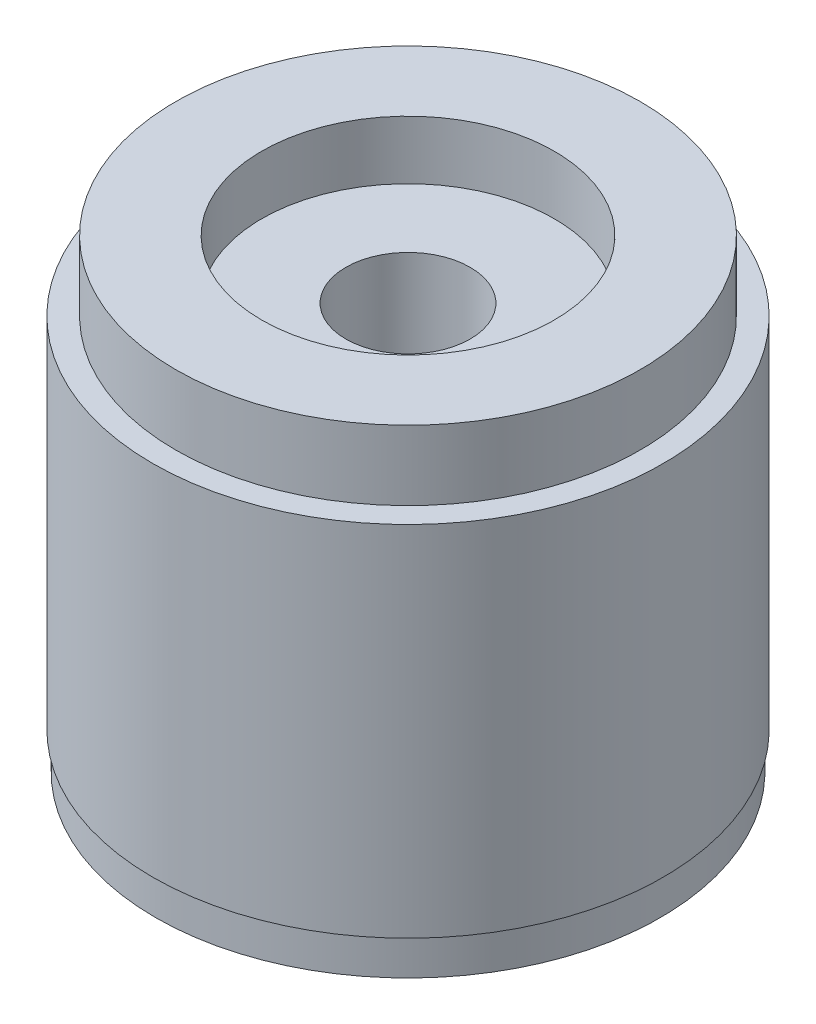
ISO-10303-21;
HEADER;
FILE_DESCRIPTION(('STEP AP214'),'2;1');
FILE_NAME('part.step','',(''),(''),'','','');
FILE_SCHEMA(('AUTOMOTIVE_DESIGN { 1 0 10303 214 1 1 1 1 }'));
ENDSEC;
DATA;
#1=APPLICATION_CONTEXT('core data for automotive mechanical design processes');
#2=APPLICATION_PROTOCOL_DEFINITION('international standard','automotive_design',2000,#1);
#3=PRODUCT_CONTEXT('',#1,'mechanical');
#4=PRODUCT('Part','Part','',(#3));
#5=PRODUCT_RELATED_PRODUCT_CATEGORY('part','',(#4));
#6=PRODUCT_DEFINITION_FORMATION('','',#4);
#7=PRODUCT_DEFINITION_CONTEXT('part definition',#1,'design');
#8=PRODUCT_DEFINITION('design','',#6,#7);
#9=PRODUCT_DEFINITION_SHAPE('','',#8);
#10=(LENGTH_UNIT() NAMED_UNIT(*) SI_UNIT(.MILLI.,.METRE.));
#11=(NAMED_UNIT(*) PLANE_ANGLE_UNIT() SI_UNIT($,.RADIAN.));
#12=(NAMED_UNIT(*) SI_UNIT($,.STERADIAN.) SOLID_ANGLE_UNIT());
#13=UNCERTAINTY_MEASURE_WITH_UNIT(LENGTH_MEASURE(1.E-05),#10,'distance_accuracy_value','');
#14=(GEOMETRIC_REPRESENTATION_CONTEXT(3) GLOBAL_UNCERTAINTY_ASSIGNED_CONTEXT((#13)) GLOBAL_UNIT_ASSIGNED_CONTEXT((#10,
#11,#12)) REPRESENTATION_CONTEXT('',''));
#15=CARTESIAN_POINT('',(0.,0.,0.));
#16=DIRECTION('',(0.,0.,1.));
#17=DIRECTION('',(1.,0.,0.));
#18=AXIS2_PLACEMENT_3D('',#15,#16,#17);
#19=CARTESIAN_POINT('',(0.,63.5,0.));
#20=DIRECTION('',(0.,-1.,0.));
#21=DIRECTION('',(0.,0.,-1.));
#22=AXIS2_PLACEMENT_3D('',#19,#20,#21);
#23=CYLINDRICAL_SURFACE('',#22,8.5);
#24=CARTESIAN_POINT('',(0.,55.5,0.));
#25=DIRECTION('',(0.,1.,0.));
#26=DIRECTION('',(0.,0.,1.));
#27=AXIS2_PLACEMENT_3D('',#24,#25,#26);
#28=CIRCLE('',#27,8.5);
#29=CARTESIAN_POINT('',(0.,55.5,8.5));
#30=VERTEX_POINT('',#29);
#31=EDGE_CURVE('E55',#30,#30,#28,.T.);
#32=ORIENTED_EDGE('',*,*,#31,.T.);
#33=EDGE_LOOP('',(#32));
#34=FACE_BOUND('',#33,.T.);
#35=CARTESIAN_POINT('',(0.,5.,0.));
#36=DIRECTION('',(0.,-1.,0.));
#37=DIRECTION('',(0.,0.,-1.));
#38=AXIS2_PLACEMENT_3D('',#35,#36,#37);
#39=CIRCLE('',#38,8.5);
#40=CARTESIAN_POINT('',(0.,5.,-8.5));
#41=VERTEX_POINT('',#40);
#42=EDGE_CURVE('E39',#41,#41,#39,.F.);
#43=ORIENTED_EDGE('',*,*,#42,.F.);
#44=EDGE_LOOP('',(#43));
#45=FACE_BOUND('',#44,.T.);
#46=ADVANCED_FACE('F35',(#34,#45),#23,.F.);
#47=CARTESIAN_POINT('',(0.,63.5,0.));
#48=DIRECTION('',(0.,-1.,0.));
#49=DIRECTION('',(0.,0.,-1.));
#50=AXIS2_PLACEMENT_3D('',#47,#48,#49);
#51=CYLINDRICAL_SURFACE('',#50,34.91);
#52=CARTESIAN_POINT('',(0.,5.,0.));
#53=DIRECTION('',(0.,-1.,0.));
#54=DIRECTION('',(0.,0.,-1.));
#55=AXIS2_PLACEMENT_3D('',#52,#53,#54);
#56=CIRCLE('',#55,34.91);
#57=CARTESIAN_POINT('',(0.,5.,-34.91));
#58=VERTEX_POINT('',#57);
#59=EDGE_CURVE('E11',#58,#58,#56,.T.);
#60=ORIENTED_EDGE('',*,*,#59,.F.);
#61=EDGE_LOOP('',(#60));
#62=FACE_BOUND('',#61,.T.);
#63=CARTESIAN_POINT('',(0.,53.98,0.));
#64=DIRECTION('',(0.,1.,0.));
#65=DIRECTION('',(0.,0.,1.));
#66=AXIS2_PLACEMENT_3D('',#63,#64,#65);
#67=CIRCLE('',#66,34.91);
#68=CARTESIAN_POINT('',(0.,53.98,34.91));
#69=VERTEX_POINT('',#68);
#70=EDGE_CURVE('E52',#69,#69,#67,.T.);
#71=ORIENTED_EDGE('',*,*,#70,.F.);
#72=EDGE_LOOP('',(#71));
#73=FACE_BOUND('',#72,.T.);
#74=ADVANCED_FACE('F37',(#62,#73),#51,.T.);
#75=CARTESIAN_POINT('',(0.,5.,0.));
#76=DIRECTION('',(0.,-1.,0.));
#77=DIRECTION('',(0.,0.,-1.));
#78=AXIS2_PLACEMENT_3D('',#75,#76,#77);
#79=PLANE('',#78);
#80=CARTESIAN_POINT('',(0.,5.,0.));
#81=DIRECTION('',(0.,-1.,0.));
#82=DIRECTION('',(0.,0.,-1.));
#83=AXIS2_PLACEMENT_3D('',#80,#81,#82);
#84=CIRCLE('',#83,34.5);
#85=CARTESIAN_POINT('',(0.,5.,-34.5));
#86=VERTEX_POINT('',#85);
#87=EDGE_CURVE('E43',#86,#86,#84,.T.);
#88=ORIENTED_EDGE('',*,*,#87,.F.);
#89=EDGE_LOOP('',(#88));
#90=FACE_BOUND('',#89,.T.);
#91=ORIENTED_EDGE('',*,*,#59,.T.);
#92=EDGE_LOOP('',(#91));
#93=FACE_BOUND('',#92,.T.);
#94=ADVANCED_FACE('F106',(#90,#93),#79,.T.);
#95=CARTESIAN_POINT('',(0.,5.,0.));
#96=DIRECTION('',(0.,-1.,0.));
#97=DIRECTION('',(0.,0.,-1.));
#98=AXIS2_PLACEMENT_3D('',#95,#96,#97);
#99=CYLINDRICAL_SURFACE('',#98,34.5);
#100=ORIENTED_EDGE('',*,*,#87,.T.);
#101=EDGE_LOOP('',(#100));
#102=FACE_BOUND('',#101,.T.);
#103=CARTESIAN_POINT('',(0.,0.,0.));
#104=DIRECTION('',(0.,-1.,0.));
#105=DIRECTION('',(0.,0.,-1.));
#106=AXIS2_PLACEMENT_3D('',#103,#104,#105);
#107=CIRCLE('',#106,34.5);
#108=CARTESIAN_POINT('',(0.,0.,-34.5));
#109=VERTEX_POINT('',#108);
#110=EDGE_CURVE('E48',#109,#109,#107,.T.);
#111=ORIENTED_EDGE('',*,*,#110,.F.);
#112=EDGE_LOOP('',(#111));
#113=FACE_BOUND('',#112,.T.);
#114=ADVANCED_FACE('F178',(#102,#113),#99,.T.);
#115=CARTESIAN_POINT('',(0.,0.,0.));
#116=DIRECTION('',(0.,1.,0.));
#117=DIRECTION('',(0.,0.,1.));
#118=AXIS2_PLACEMENT_3D('',#115,#116,#117);
#119=PLANE('',#118);
#120=CARTESIAN_POINT('',(0.,0.,0.));
#121=DIRECTION('',(0.,-1.,0.));
#122=DIRECTION('',(0.,0.,-1.));
#123=AXIS2_PLACEMENT_3D('',#120,#121,#122);
#124=CIRCLE('',#123,14.5);
#125=CARTESIAN_POINT('',(0.,0.,-14.5));
#126=VERTEX_POINT('',#125);
#127=EDGE_CURVE('E68',#126,#126,#124,.T.);
#128=ORIENTED_EDGE('',*,*,#127,.F.);
#129=EDGE_LOOP('',(#128));
#130=FACE_BOUND('',#129,.T.);
#131=ORIENTED_EDGE('',*,*,#110,.T.);
#132=EDGE_LOOP('',(#131));
#133=FACE_BOUND('',#132,.T.);
#134=ADVANCED_FACE('F97',(#130,#133),#119,.F.);
#135=CARTESIAN_POINT('',(0.,53.98,0.));
#136=DIRECTION('',(0.,1.,0.));
#137=DIRECTION('',(0.,0.,1.));
#138=AXIS2_PLACEMENT_3D('',#135,#136,#137);
#139=PLANE('',#138);
#140=CARTESIAN_POINT('',(0.,53.98,0.));
#141=DIRECTION('',(0.,1.,0.));
#142=DIRECTION('',(0.,0.,1.));
#143=AXIS2_PLACEMENT_3D('',#140,#141,#142);
#144=CIRCLE('',#143,31.75);
#145=CARTESIAN_POINT('',(0.,53.98,31.75));
#146=VERTEX_POINT('',#145);
#147=EDGE_CURVE('E54',#146,#146,#144,.T.);
#148=ORIENTED_EDGE('',*,*,#147,.F.);
#149=EDGE_LOOP('',(#148));
#150=FACE_BOUND('',#149,.T.);
#151=ORIENTED_EDGE('',*,*,#70,.T.);
#152=EDGE_LOOP('',(#151));
#153=FACE_BOUND('',#152,.T.);
#154=ADVANCED_FACE('F87',(#150,#153),#139,.T.);
#155=CARTESIAN_POINT('',(0.,53.98,0.));
#156=DIRECTION('',(0.,1.,0.));
#157=DIRECTION('',(0.,0.,1.));
#158=AXIS2_PLACEMENT_3D('',#155,#156,#157);
#159=CYLINDRICAL_SURFACE('',#158,31.75);
#160=ORIENTED_EDGE('',*,*,#147,.T.);
#161=EDGE_LOOP('',(#160));
#162=FACE_BOUND('',#161,.T.);
#163=CARTESIAN_POINT('',(0.,63.5,0.));
#164=DIRECTION('',(0.,1.,0.));
#165=DIRECTION('',(0.,0.,1.));
#166=AXIS2_PLACEMENT_3D('',#163,#164,#165);
#167=CIRCLE('',#166,31.75);
#168=CARTESIAN_POINT('',(0.,63.5,31.75));
#169=VERTEX_POINT('',#168);
#170=EDGE_CURVE('E76',#169,#169,#167,.T.);
#171=ORIENTED_EDGE('',*,*,#170,.F.);
#172=EDGE_LOOP('',(#171));
#173=FACE_BOUND('',#172,.T.);
#174=ADVANCED_FACE('F85',(#162,#173),#159,.T.);
#175=CARTESIAN_POINT('',(0.,63.5,0.));
#176=DIRECTION('',(0.,1.,0.));
#177=DIRECTION('',(0.,0.,1.));
#178=AXIS2_PLACEMENT_3D('',#175,#176,#177);
#179=PLANE('',#178);
#180=CARTESIAN_POINT('',(0.,63.5,0.));
#181=DIRECTION('',(0.,1.,0.));
#182=DIRECTION('',(0.,0.,1.));
#183=AXIS2_PLACEMENT_3D('',#180,#181,#182);
#184=CIRCLE('',#183,20.);
#185=CARTESIAN_POINT('',(0.,63.5,20.));
#186=VERTEX_POINT('',#185);
#187=EDGE_CURVE('E57',#186,#186,#184,.T.);
#188=ORIENTED_EDGE('',*,*,#187,.F.);
#189=EDGE_LOOP('',(#188));
#190=FACE_BOUND('',#189,.T.);
#191=ORIENTED_EDGE('',*,*,#170,.T.);
#192=EDGE_LOOP('',(#191));
#193=FACE_BOUND('',#192,.T.);
#194=ADVANCED_FACE('F83',(#190,#193),#179,.T.);
#195=CARTESIAN_POINT('',(0.,55.5,0.));
#196=DIRECTION('',(0.,1.,0.));
#197=DIRECTION('',(0.,0.,1.));
#198=AXIS2_PLACEMENT_3D('',#195,#196,#197);
#199=CYLINDRICAL_SURFACE('',#198,20.);
#200=CARTESIAN_POINT('',(0.,55.5,0.));
#201=DIRECTION('',(0.,1.,0.));
#202=DIRECTION('',(0.,0.,1.));
#203=AXIS2_PLACEMENT_3D('',#200,#201,#202);
#204=CIRCLE('',#203,20.);
#205=CARTESIAN_POINT('',(0.,55.5,20.));
#206=VERTEX_POINT('',#205);
#207=EDGE_CURVE('E61',#206,#206,#204,.T.);
#208=ORIENTED_EDGE('',*,*,#207,.F.);
#209=EDGE_LOOP('',(#208));
#210=FACE_BOUND('',#209,.T.);
#211=ORIENTED_EDGE('',*,*,#187,.T.);
#212=EDGE_LOOP('',(#211));
#213=FACE_BOUND('',#212,.T.);
#214=ADVANCED_FACE('F94',(#210,#213),#199,.F.);
#215=CARTESIAN_POINT('',(0.,55.5,0.));
#216=DIRECTION('',(0.,1.,0.));
#217=DIRECTION('',(0.,0.,1.));
#218=AXIS2_PLACEMENT_3D('',#215,#216,#217);
#219=PLANE('',#218);
#220=ORIENTED_EDGE('',*,*,#31,.F.);
#221=EDGE_LOOP('',(#220));
#222=FACE_BOUND('',#221,.T.);
#223=ORIENTED_EDGE('',*,*,#207,.T.);
#224=EDGE_LOOP('',(#223));
#225=FACE_BOUND('',#224,.T.);
#226=ADVANCED_FACE('F113',(#222,#225),#219,.T.);
#227=CARTESIAN_POINT('',(0.,5.,0.));
#228=DIRECTION('',(0.,-1.,0.));
#229=DIRECTION('',(0.,0.,-1.));
#230=AXIS2_PLACEMENT_3D('',#227,#228,#229);
#231=PLANE('',#230);
#232=CARTESIAN_POINT('',(0.,5.,0.));
#233=DIRECTION('',(0.,-1.,0.));
#234=DIRECTION('',(0.,0.,-1.));
#235=AXIS2_PLACEMENT_3D('',#232,#233,#234);
#236=CIRCLE('',#235,14.5);
#237=CARTESIAN_POINT('',(0.,5.,-14.5));
#238=VERTEX_POINT('',#237);
#239=EDGE_CURVE('E64',#238,#238,#236,.T.);
#240=ORIENTED_EDGE('',*,*,#239,.T.);
#241=EDGE_LOOP('',(#240));
#242=FACE_BOUND('',#241,.T.);
#243=ORIENTED_EDGE('',*,*,#42,.T.);
#244=EDGE_LOOP('',(#243));
#245=FACE_BOUND('',#244,.T.);
#246=ADVANCED_FACE('F115',(#242,#245),#231,.T.);
#247=CARTESIAN_POINT('',(0.,5.,0.));
#248=DIRECTION('',(0.,-1.,0.));
#249=DIRECTION('',(0.,0.,-1.));
#250=AXIS2_PLACEMENT_3D('',#247,#248,#249);
#251=CYLINDRICAL_SURFACE('',#250,14.5);
#252=ORIENTED_EDGE('',*,*,#239,.F.);
#253=EDGE_LOOP('',(#252));
#254=FACE_BOUND('',#253,.T.);
#255=ORIENTED_EDGE('',*,*,#127,.T.);
#256=EDGE_LOOP('',(#255));
#257=FACE_BOUND('',#256,.T.);
#258=ADVANCED_FACE('F111',(#254,#257),#251,.F.);
#259=CLOSED_SHELL('',(#46,#74,#94,#114,#134,#154,#174,#194,#214,#226,#246,#258));
#260=MANIFOLD_SOLID_BREP('B2',#259);
#261=ADVANCED_BREP_SHAPE_REPRESENTATION('',(#18,#260),#14);
#262=SHAPE_DEFINITION_REPRESENTATION(#9,#261);
ENDSEC;
END-ISO-10303-21;
